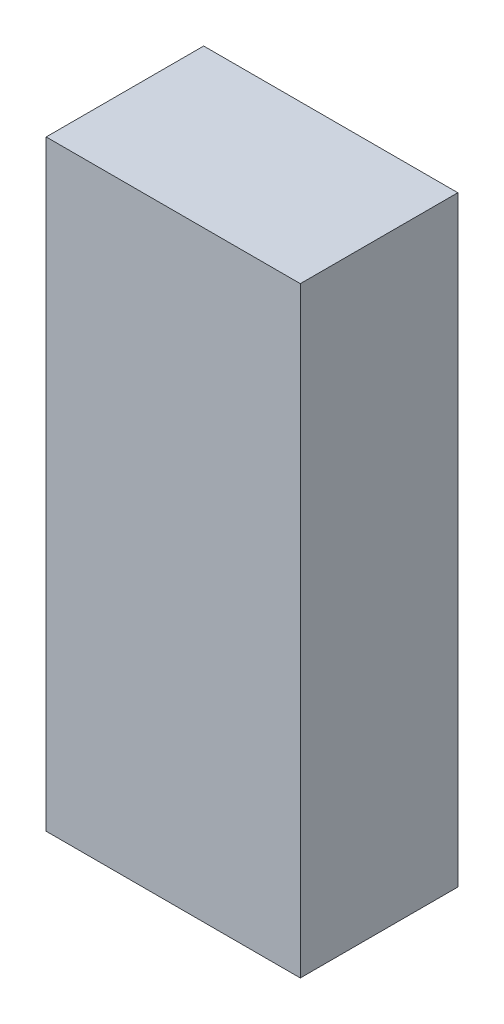
ISO-10303-21;
HEADER;
FILE_DESCRIPTION(('STEP AP214'),'2;1');
FILE_NAME('part.step','',(''),(''),'','','');
FILE_SCHEMA(('AUTOMOTIVE_DESIGN { 1 0 10303 214 1 1 1 1 }'));
ENDSEC;
DATA;
#1=APPLICATION_CONTEXT('core data for automotive mechanical design processes');
#2=APPLICATION_PROTOCOL_DEFINITION('international standard','automotive_design',2000,#1);
#3=PRODUCT_CONTEXT('',#1,'mechanical');
#4=PRODUCT('Part','Part','',(#3));
#5=PRODUCT_RELATED_PRODUCT_CATEGORY('part','',(#4));
#6=PRODUCT_DEFINITION_FORMATION('','',#4);
#7=PRODUCT_DEFINITION_CONTEXT('part definition',#1,'design');
#8=PRODUCT_DEFINITION('design','',#6,#7);
#9=PRODUCT_DEFINITION_SHAPE('','',#8);
#10=(LENGTH_UNIT() NAMED_UNIT(*) SI_UNIT(.MILLI.,.METRE.));
#11=(NAMED_UNIT(*) PLANE_ANGLE_UNIT() SI_UNIT($,.RADIAN.));
#12=(NAMED_UNIT(*) SI_UNIT($,.STERADIAN.) SOLID_ANGLE_UNIT());
#13=UNCERTAINTY_MEASURE_WITH_UNIT(LENGTH_MEASURE(1.E-05),#10,'distance_accuracy_value','');
#14=(GEOMETRIC_REPRESENTATION_CONTEXT(3) GLOBAL_UNCERTAINTY_ASSIGNED_CONTEXT((#13)) GLOBAL_UNIT_ASSIGNED_CONTEXT((#10,
#11,#12)) REPRESENTATION_CONTEXT('',''));
#15=CARTESIAN_POINT('',(0.,0.,0.));
#16=DIRECTION('',(0.,0.,1.));
#17=DIRECTION('',(1.,0.,0.));
#18=AXIS2_PLACEMENT_3D('',#15,#16,#17);
#19=CARTESIAN_POINT('',(-450.85,2133.6,-279.4));
#20=DIRECTION('',(0.,0.,1.));
#21=DIRECTION('',(1.,0.,0.));
#22=AXIS2_PLACEMENT_3D('',#19,#20,#21);
#23=PLANE('',#22);
#24=DIRECTION('',(-1.,0.,0.));
#25=VECTOR('',#24,1.);
#26=CARTESIAN_POINT('',(-450.85,0.,-279.4));
#27=LINE('',#26,#25);
#28=CARTESIAN_POINT('',(450.85,0.,-279.4));
#29=VERTEX_POINT('',#28);
#30=CARTESIAN_POINT('',(-450.85,0.,-279.4));
#31=VERTEX_POINT('',#30);
#32=EDGE_CURVE('E157',#29,#31,#27,.T.);
#33=ORIENTED_EDGE('',*,*,#32,.T.);
#34=DIRECTION('',(0.,-1.,0.));
#35=VECTOR('',#34,1.);
#36=CARTESIAN_POINT('',(-450.85,2133.6,-279.4));
#37=LINE('',#36,#35);
#38=CARTESIAN_POINT('',(-450.85,2133.6,-279.4));
#39=VERTEX_POINT('',#38);
#40=EDGE_CURVE('E42',#39,#31,#37,.T.);
#41=ORIENTED_EDGE('',*,*,#40,.F.);
#42=DIRECTION('',(-1.,0.,0.));
#43=VECTOR('',#42,1.);
#44=CARTESIAN_POINT('',(-450.85,2133.6,-279.4));
#45=LINE('',#44,#43);
#46=CARTESIAN_POINT('',(450.85,2133.6,-279.4));
#47=VERTEX_POINT('',#46);
#48=EDGE_CURVE('E86',#47,#39,#45,.T.);
#49=ORIENTED_EDGE('',*,*,#48,.F.);
#50=DIRECTION('',(0.,-1.,0.));
#51=VECTOR('',#50,1.);
#52=CARTESIAN_POINT('',(450.85,2133.6,-279.4));
#53=LINE('',#52,#51);
#54=EDGE_CURVE('E11',#47,#29,#53,.T.);
#55=ORIENTED_EDGE('',*,*,#54,.T.);
#56=EDGE_LOOP('',(#33,#41,#49,#55));
#57=FACE_BOUND('',#56,.T.);
#58=DIRECTION('',(-1.,0.,0.));
#59=VECTOR('',#58,1.);
#60=CARTESIAN_POINT('',(0.,3.175,-279.4));
#61=LINE('',#60,#59);
#62=CARTESIAN_POINT('',(447.675,3.175,-279.4));
#63=VERTEX_POINT('',#62);
#64=CARTESIAN_POINT('',(-447.675,3.175,-279.4));
#65=VERTEX_POINT('',#64);
#66=EDGE_CURVE('E130',#63,#65,#61,.T.);
#67=ORIENTED_EDGE('',*,*,#66,.F.);
#68=DIRECTION('',(0.,-1.,0.));
#69=VECTOR('',#68,1.);
#70=CARTESIAN_POINT('',(447.675,2133.6,-279.4));
#71=LINE('',#70,#69);
#72=CARTESIAN_POINT('',(447.675,2130.425,-279.4));
#73=VERTEX_POINT('',#72);
#74=EDGE_CURVE('E129',#73,#63,#71,.T.);
#75=ORIENTED_EDGE('',*,*,#74,.F.);
#76=DIRECTION('',(-1.,0.,0.));
#77=VECTOR('',#76,1.);
#78=CARTESIAN_POINT('',(0.,2130.425,-279.4));
#79=LINE('',#78,#77);
#80=CARTESIAN_POINT('',(-447.675,2130.425,-279.4));
#81=VERTEX_POINT('',#80);
#82=EDGE_CURVE('E134',#73,#81,#79,.T.);
#83=ORIENTED_EDGE('',*,*,#82,.T.);
#84=DIRECTION('',(0.,-1.,0.));
#85=VECTOR('',#84,1.);
#86=CARTESIAN_POINT('',(-447.675,2133.6,-279.4));
#87=LINE('',#86,#85);
#88=EDGE_CURVE('E139',#81,#65,#87,.T.);
#89=ORIENTED_EDGE('',*,*,#88,.T.);
#90=EDGE_LOOP('',(#67,#75,#83,#89));
#91=FACE_BOUND('',#90,.T.);
#92=ADVANCED_FACE('F34',(#57,#91),#23,.F.);
#93=CARTESIAN_POINT('',(450.85,2133.6,279.4));
#94=DIRECTION('',(-1.,0.,0.));
#95=DIRECTION('',(0.,0.,1.));
#96=AXIS2_PLACEMENT_3D('',#93,#94,#95);
#97=PLANE('',#96);
#98=DIRECTION('',(0.,0.,-1.));
#99=VECTOR('',#98,1.);
#100=CARTESIAN_POINT('',(450.85,0.,279.4));
#101=LINE('',#100,#99);
#102=CARTESIAN_POINT('',(450.85,0.,279.4));
#103=VERTEX_POINT('',#102);
#104=EDGE_CURVE('E142',#103,#29,#101,.T.);
#105=ORIENTED_EDGE('',*,*,#104,.T.);
#106=ORIENTED_EDGE('',*,*,#54,.F.);
#107=DIRECTION('',(0.,0.,-1.));
#108=VECTOR('',#107,1.);
#109=CARTESIAN_POINT('',(450.85,2133.6,279.4));
#110=LINE('',#109,#108);
#111=CARTESIAN_POINT('',(450.85,2133.6,279.4));
#112=VERTEX_POINT('',#111);
#113=EDGE_CURVE('E148',#112,#47,#110,.T.);
#114=ORIENTED_EDGE('',*,*,#113,.F.);
#115=DIRECTION('',(0.,-1.,0.));
#116=VECTOR('',#115,1.);
#117=CARTESIAN_POINT('',(450.85,2133.6,279.4));
#118=LINE('',#117,#116);
#119=EDGE_CURVE('E154',#112,#103,#118,.T.);
#120=ORIENTED_EDGE('',*,*,#119,.T.);
#121=EDGE_LOOP('',(#105,#106,#114,#120));
#122=FACE_BOUND('',#121,.T.);
#123=ADVANCED_FACE('F36',(#122),#97,.F.);
#124=CARTESIAN_POINT('',(-450.85,2133.6,279.4));
#125=DIRECTION('',(1.,0.,0.));
#126=DIRECTION('',(0.,0.,-1.));
#127=AXIS2_PLACEMENT_3D('',#124,#125,#126);
#128=PLANE('',#127);
#129=DIRECTION('',(0.,0.,1.));
#130=VECTOR('',#129,1.);
#131=CARTESIAN_POINT('',(-450.85,0.,279.4));
#132=LINE('',#131,#130);
#133=CARTESIAN_POINT('',(-450.85,0.,279.4));
#134=VERTEX_POINT('',#133);
#135=EDGE_CURVE('E159',#31,#134,#132,.T.);
#136=ORIENTED_EDGE('',*,*,#135,.T.);
#137=DIRECTION('',(0.,-1.,0.));
#138=VECTOR('',#137,1.);
#139=CARTESIAN_POINT('',(-450.85,2133.6,279.4));
#140=LINE('',#139,#138);
#141=CARTESIAN_POINT('',(-450.85,2133.6,279.4));
#142=VERTEX_POINT('',#141);
#143=EDGE_CURVE('E163',#142,#134,#140,.T.);
#144=ORIENTED_EDGE('',*,*,#143,.F.);
#145=DIRECTION('',(0.,0.,1.));
#146=VECTOR('',#145,1.);
#147=CARTESIAN_POINT('',(-450.85,2133.6,279.4));
#148=LINE('',#147,#146);
#149=EDGE_CURVE('E151',#39,#142,#148,.T.);
#150=ORIENTED_EDGE('',*,*,#149,.F.);
#151=ORIENTED_EDGE('',*,*,#40,.T.);
#152=EDGE_LOOP('',(#136,#144,#150,#151));
#153=FACE_BOUND('',#152,.T.);
#154=ADVANCED_FACE('F168',(#153),#128,.F.);
#155=CARTESIAN_POINT('',(-450.85,2133.6,279.4));
#156=DIRECTION('',(0.,0.,-1.));
#157=DIRECTION('',(-1.,0.,0.));
#158=AXIS2_PLACEMENT_3D('',#155,#156,#157);
#159=PLANE('',#158);
#160=DIRECTION('',(1.,0.,0.));
#161=VECTOR('',#160,1.);
#162=CARTESIAN_POINT('',(-450.85,0.,279.4));
#163=LINE('',#162,#161);
#164=EDGE_CURVE('E79',#134,#103,#163,.T.);
#165=ORIENTED_EDGE('',*,*,#164,.T.);
#166=ORIENTED_EDGE('',*,*,#119,.F.);
#167=DIRECTION('',(1.,0.,0.));
#168=VECTOR('',#167,1.);
#169=CARTESIAN_POINT('',(-450.85,2133.6,279.4));
#170=LINE('',#169,#168);
#171=EDGE_CURVE('E58',#142,#112,#170,.T.);
#172=ORIENTED_EDGE('',*,*,#171,.F.);
#173=ORIENTED_EDGE('',*,*,#143,.T.);
#174=EDGE_LOOP('',(#165,#166,#172,#173));
#175=FACE_BOUND('',#174,.T.);
#176=ADVANCED_FACE('F176',(#175),#159,.F.);
#177=CARTESIAN_POINT('',(0.,2133.6,0.));
#178=DIRECTION('',(0.,-1.,0.));
#179=DIRECTION('',(0.,0.,-1.));
#180=AXIS2_PLACEMENT_3D('',#177,#178,#179);
#181=PLANE('',#180);
#182=ORIENTED_EDGE('',*,*,#113,.T.);
#183=ORIENTED_EDGE('',*,*,#48,.T.);
#184=ORIENTED_EDGE('',*,*,#149,.T.);
#185=ORIENTED_EDGE('',*,*,#171,.T.);
#186=EDGE_LOOP('',(#182,#183,#184,#185));
#187=FACE_BOUND('',#186,.T.);
#188=ADVANCED_FACE('F178',(#187),#181,.F.);
#189=CARTESIAN_POINT('',(0.,0.,0.));
#190=DIRECTION('',(0.,-1.,0.));
#191=DIRECTION('',(0.,0.,-1.));
#192=AXIS2_PLACEMENT_3D('',#189,#190,#191);
#193=PLANE('',#192);
#194=ORIENTED_EDGE('',*,*,#104,.F.);
#195=ORIENTED_EDGE('',*,*,#164,.F.);
#196=ORIENTED_EDGE('',*,*,#135,.F.);
#197=ORIENTED_EDGE('',*,*,#32,.F.);
#198=EDGE_LOOP('',(#194,#195,#196,#197));
#199=FACE_BOUND('',#198,.T.);
#200=ADVANCED_FACE('F172',(#199),#193,.T.);
#201=CARTESIAN_POINT('',(447.675,2133.6,279.4));
#202=DIRECTION('',(-1.,0.,0.));
#203=DIRECTION('',(0.,0.,1.));
#204=AXIS2_PLACEMENT_3D('',#201,#202,#203);
#205=PLANE('',#204);
#206=DIRECTION('',(0.,0.,-1.));
#207=VECTOR('',#206,1.);
#208=CARTESIAN_POINT('',(447.675,3.175,0.));
#209=LINE('',#208,#207);
#210=CARTESIAN_POINT('',(447.675,3.175,276.225));
#211=VERTEX_POINT('',#210);
#212=EDGE_CURVE('E113',#211,#63,#209,.T.);
#213=ORIENTED_EDGE('',*,*,#212,.F.);
#214=DIRECTION('',(0.,-1.,0.));
#215=VECTOR('',#214,1.);
#216=CARTESIAN_POINT('',(447.675,2133.6,276.225));
#217=LINE('',#216,#215);
#218=CARTESIAN_POINT('',(447.675,2130.425,276.225));
#219=VERTEX_POINT('',#218);
#220=EDGE_CURVE('E121',#219,#211,#217,.T.);
#221=ORIENTED_EDGE('',*,*,#220,.F.);
#222=DIRECTION('',(0.,0.,-1.));
#223=VECTOR('',#222,1.);
#224=CARTESIAN_POINT('',(447.675,2130.425,0.));
#225=LINE('',#224,#223);
#226=EDGE_CURVE('E49',#219,#73,#225,.T.);
#227=ORIENTED_EDGE('',*,*,#226,.T.);
#228=ORIENTED_EDGE('',*,*,#74,.T.);
#229=EDGE_LOOP('',(#213,#221,#227,#228));
#230=FACE_BOUND('',#229,.T.);
#231=ADVANCED_FACE('F127',(#230),#205,.T.);
#232=CARTESIAN_POINT('',(-447.675,2133.6,279.4));
#233=DIRECTION('',(1.,0.,0.));
#234=DIRECTION('',(0.,0.,-1.));
#235=AXIS2_PLACEMENT_3D('',#232,#233,#234);
#236=PLANE('',#235);
#237=DIRECTION('',(0.,0.,1.));
#238=VECTOR('',#237,1.);
#239=CARTESIAN_POINT('',(-447.675,3.175,0.));
#240=LINE('',#239,#238);
#241=CARTESIAN_POINT('',(-447.675,3.175,276.225));
#242=VERTEX_POINT('',#241);
#243=EDGE_CURVE('E116',#65,#242,#240,.T.);
#244=ORIENTED_EDGE('',*,*,#243,.F.);
#245=ORIENTED_EDGE('',*,*,#88,.F.);
#246=DIRECTION('',(0.,0.,1.));
#247=VECTOR('',#246,1.);
#248=CARTESIAN_POINT('',(-447.675,2130.425,0.));
#249=LINE('',#248,#247);
#250=CARTESIAN_POINT('',(-447.675,2130.425,276.225));
#251=VERTEX_POINT('',#250);
#252=EDGE_CURVE('E137',#81,#251,#249,.T.);
#253=ORIENTED_EDGE('',*,*,#252,.T.);
#254=DIRECTION('',(0.,-1.,0.));
#255=VECTOR('',#254,1.);
#256=CARTESIAN_POINT('',(-447.675,2133.6,276.225));
#257=LINE('',#256,#255);
#258=EDGE_CURVE('E125',#251,#242,#257,.T.);
#259=ORIENTED_EDGE('',*,*,#258,.T.);
#260=EDGE_LOOP('',(#244,#245,#253,#259));
#261=FACE_BOUND('',#260,.T.);
#262=ADVANCED_FACE('F195',(#261),#236,.T.);
#263=CARTESIAN_POINT('',(-450.85,2133.6,276.225));
#264=DIRECTION('',(0.,0.,-1.));
#265=DIRECTION('',(-1.,0.,0.));
#266=AXIS2_PLACEMENT_3D('',#263,#264,#265);
#267=PLANE('',#266);
#268=DIRECTION('',(1.,0.,0.));
#269=VECTOR('',#268,1.);
#270=CARTESIAN_POINT('',(0.,3.175,276.225));
#271=LINE('',#270,#269);
#272=EDGE_CURVE('E109',#242,#211,#271,.T.);
#273=ORIENTED_EDGE('',*,*,#272,.F.);
#274=ORIENTED_EDGE('',*,*,#258,.F.);
#275=DIRECTION('',(1.,0.,0.));
#276=VECTOR('',#275,1.);
#277=CARTESIAN_POINT('',(0.,2130.425,276.225));
#278=LINE('',#277,#276);
#279=EDGE_CURVE('E124',#251,#219,#278,.T.);
#280=ORIENTED_EDGE('',*,*,#279,.T.);
#281=ORIENTED_EDGE('',*,*,#220,.T.);
#282=EDGE_LOOP('',(#273,#274,#280,#281));
#283=FACE_BOUND('',#282,.T.);
#284=ADVANCED_FACE('F122',(#283),#267,.T.);
#285=CARTESIAN_POINT('',(0.,2130.425,0.));
#286=DIRECTION('',(0.,-1.,0.));
#287=DIRECTION('',(0.,0.,-1.));
#288=AXIS2_PLACEMENT_3D('',#285,#286,#287);
#289=PLANE('',#288);
#290=ORIENTED_EDGE('',*,*,#226,.F.);
#291=ORIENTED_EDGE('',*,*,#279,.F.);
#292=ORIENTED_EDGE('',*,*,#252,.F.);
#293=ORIENTED_EDGE('',*,*,#82,.F.);
#294=EDGE_LOOP('',(#290,#291,#292,#293));
#295=FACE_BOUND('',#294,.T.);
#296=ADVANCED_FACE('F198',(#295),#289,.T.);
#297=CARTESIAN_POINT('',(0.,3.175,0.));
#298=DIRECTION('',(0.,-1.,0.));
#299=DIRECTION('',(0.,0.,-1.));
#300=AXIS2_PLACEMENT_3D('',#297,#298,#299);
#301=PLANE('',#300);
#302=ORIENTED_EDGE('',*,*,#212,.T.);
#303=ORIENTED_EDGE('',*,*,#66,.T.);
#304=ORIENTED_EDGE('',*,*,#243,.T.);
#305=ORIENTED_EDGE('',*,*,#272,.T.);
#306=EDGE_LOOP('',(#302,#303,#304,#305));
#307=FACE_BOUND('',#306,.T.);
#308=ADVANCED_FACE('F111',(#307),#301,.F.);
#309=CLOSED_SHELL('',(#92,#123,#154,#176,#188,#200,#231,#262,#284,#296,#308));
#310=MANIFOLD_SOLID_BREP('B2',#309);
#311=ADVANCED_BREP_SHAPE_REPRESENTATION('',(#18,#310),#14);
#312=SHAPE_DEFINITION_REPRESENTATION(#9,#311);
ENDSEC;
END-ISO-10303-21;
